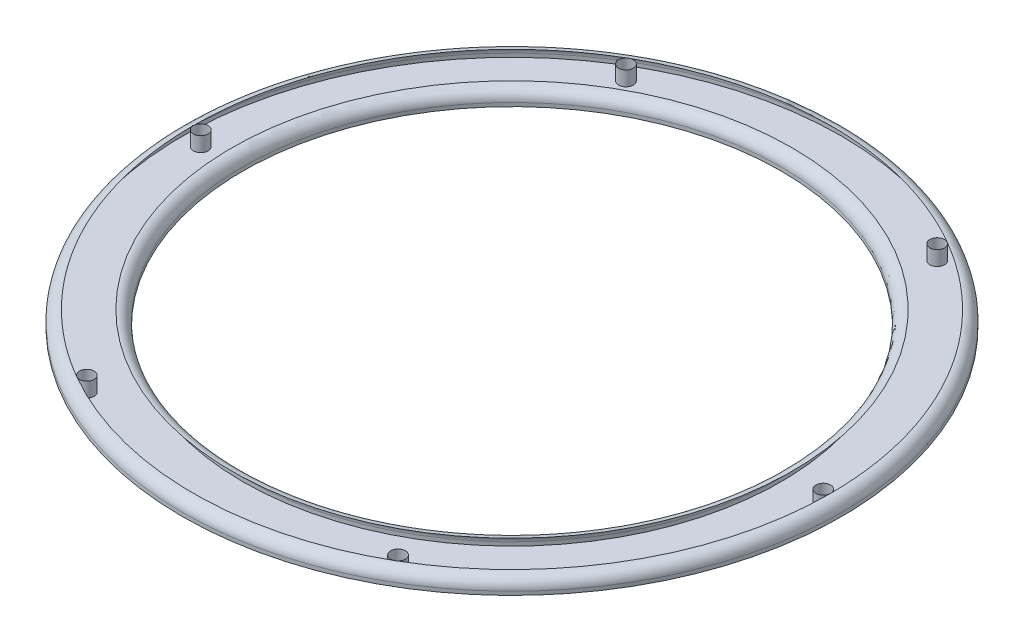
ISO-10303-21;
HEADER;
FILE_DESCRIPTION(('STEP AP214'),'2;1');
FILE_NAME('part.step','',(''),(''),'','','');
FILE_SCHEMA(('AUTOMOTIVE_DESIGN { 1 0 10303 214 1 1 1 1 }'));
ENDSEC;
DATA;
#1=APPLICATION_CONTEXT('core data for automotive mechanical design processes');
#2=APPLICATION_PROTOCOL_DEFINITION('international standard','automotive_design',2000,#1);
#3=PRODUCT_CONTEXT('',#1,'mechanical');
#4=PRODUCT('Part','Part','',(#3));
#5=PRODUCT_RELATED_PRODUCT_CATEGORY('part','',(#4));
#6=PRODUCT_DEFINITION_FORMATION('','',#4);
#7=PRODUCT_DEFINITION_CONTEXT('part definition',#1,'design');
#8=PRODUCT_DEFINITION('design','',#6,#7);
#9=PRODUCT_DEFINITION_SHAPE('','',#8);
#10=(LENGTH_UNIT() NAMED_UNIT(*) SI_UNIT(.MILLI.,.METRE.));
#11=(NAMED_UNIT(*) PLANE_ANGLE_UNIT() SI_UNIT($,.RADIAN.));
#12=(NAMED_UNIT(*) SI_UNIT($,.STERADIAN.) SOLID_ANGLE_UNIT());
#13=UNCERTAINTY_MEASURE_WITH_UNIT(LENGTH_MEASURE(1.E-05),#10,'distance_accuracy_value','');
#14=(GEOMETRIC_REPRESENTATION_CONTEXT(3) GLOBAL_UNCERTAINTY_ASSIGNED_CONTEXT((#13)) GLOBAL_UNIT_ASSIGNED_CONTEXT((#10,
#11,#12)) REPRESENTATION_CONTEXT('',''));
#15=CARTESIAN_POINT('',(0.,0.,0.));
#16=DIRECTION('',(0.,0.,1.));
#17=DIRECTION('',(1.,0.,0.));
#18=AXIS2_PLACEMENT_3D('',#15,#16,#17);
#19=CARTESIAN_POINT('',(0.,0.,0.));
#20=DIRECTION('',(0.,-1.,0.));
#21=DIRECTION('',(0.,0.,-1.));
#22=AXIS2_PLACEMENT_3D('',#19,#20,#21);
#23=CYLINDRICAL_SURFACE('',#22,73.5);
#24=CARTESIAN_POINT('',(0.,1.,0.));
#25=DIRECTION('',(0.,-1.,0.));
#26=DIRECTION('',(0.,0.,-1.));
#27=AXIS2_PLACEMENT_3D('',#24,#25,#26);
#28=CIRCLE('',#27,73.5);
#29=CARTESIAN_POINT('',(0.,1.,-73.5));
#30=VERTEX_POINT('',#29);
#31=EDGE_CURVE('E91',#30,#30,#28,.T.);
#32=ORIENTED_EDGE('',*,*,#31,.F.);
#33=EDGE_LOOP('',(#32));
#34=FACE_BOUND('',#33,.T.);
#35=CARTESIAN_POINT('',(0.,0.,0.));
#36=DIRECTION('',(0.,-1.,0.));
#37=DIRECTION('',(0.,0.,-1.));
#38=AXIS2_PLACEMENT_3D('',#35,#36,#37);
#39=CIRCLE('',#38,73.5);
#40=CARTESIAN_POINT('',(0.,0.,-73.5));
#41=VERTEX_POINT('',#40);
#42=EDGE_CURVE('E11',#41,#41,#39,.T.);
#43=ORIENTED_EDGE('',*,*,#42,.T.);
#44=EDGE_LOOP('',(#43));
#45=FACE_BOUND('',#44,.T.);
#46=ADVANCED_FACE('F38',(#34,#45),#23,.F.);
#47=CARTESIAN_POINT('',(-73.5,0.,0.));
#48=DIRECTION('',(0.,1.,0.));
#49=DIRECTION('',(0.,0.,1.));
#50=AXIS2_PLACEMENT_3D('',#47,#48,#49);
#51=PLANE('',#50);
#52=CARTESIAN_POINT('',(-42.5000000000009,0.,-73.6121593216768));
#53=DIRECTION('',(0.,1.,0.));
#54=DIRECTION('',(-0.866025403784433,0.,0.50000000000001));
#55=AXIS2_PLACEMENT_3D('',#52,#53,#54);
#56=CIRCLE('',#55,2.);
#57=CARTESIAN_POINT('',(-44.2320508075697,0.,-72.6121593216768));
#58=VERTEX_POINT('',#57);
#59=EDGE_CURVE('E182',#58,#58,#56,.T.);
#60=ORIENTED_EDGE('',*,*,#59,.T.);
#61=EDGE_LOOP('',(#60));
#62=FACE_BOUND('',#61,.T.);
#63=CARTESIAN_POINT('',(42.4999999999993,0.,-73.6121593216777));
#64=DIRECTION('',(0.,1.,0.));
#65=DIRECTION('',(-0.866025403784443,0.,-0.499999999999992));
#66=AXIS2_PLACEMENT_3D('',#63,#64,#65);
#67=CIRCLE('',#66,2.);
#68=CARTESIAN_POINT('',(40.7679491924304,0.,-74.6121593216777));
#69=VERTEX_POINT('',#68);
#70=EDGE_CURVE('E177',#69,#69,#67,.T.);
#71=ORIENTED_EDGE('',*,*,#70,.T.);
#72=EDGE_LOOP('',(#71));
#73=FACE_BOUND('',#72,.T.);
#74=CARTESIAN_POINT('',(85.,0.,0.));
#75=DIRECTION('',(0.,1.,0.));
#76=DIRECTION('',(0.,0.,-1.));
#77=AXIS2_PLACEMENT_3D('',#74,#75,#76);
#78=CIRCLE('',#77,2.);
#79=CARTESIAN_POINT('',(85.,0.,-2.));
#80=VERTEX_POINT('',#79);
#81=EDGE_CURVE('E170',#80,#80,#78,.T.);
#82=ORIENTED_EDGE('',*,*,#81,.T.);
#83=EDGE_LOOP('',(#82));
#84=FACE_BOUND('',#83,.T.);
#85=CARTESIAN_POINT('',(42.5000000000003,0.,73.6121593216771));
#86=DIRECTION('',(0.,1.,0.));
#87=DIRECTION('',(0.866025403784436,0.,-0.500000000000004));
#88=AXIS2_PLACEMENT_3D('',#85,#86,#87);
#89=CIRCLE('',#88,2.);
#90=CARTESIAN_POINT('',(44.2320508075692,0.,72.6121593216771));
#91=VERTEX_POINT('',#90);
#92=EDGE_CURVE('E167',#91,#91,#89,.T.);
#93=ORIENTED_EDGE('',*,*,#92,.T.);
#94=EDGE_LOOP('',(#93));
#95=FACE_BOUND('',#94,.T.);
#96=CARTESIAN_POINT('',(-42.4999999999998,0.,73.6121593216774));
#97=DIRECTION('',(0.,1.,0.));
#98=DIRECTION('',(0.86602540378444,0.,0.499999999999998));
#99=AXIS2_PLACEMENT_3D('',#96,#97,#98);
#100=CIRCLE('',#99,2.);
#101=CARTESIAN_POINT('',(-40.767949192431,0.,74.6121593216774));
#102=VERTEX_POINT('',#101);
#103=EDGE_CURVE('E88',#102,#102,#100,.T.);
#104=ORIENTED_EDGE('',*,*,#103,.T.);
#105=EDGE_LOOP('',(#104));
#106=FACE_BOUND('',#105,.T.);
#107=CARTESIAN_POINT('',(-85.,0.,0.));
#108=DIRECTION('',(0.,1.,0.));
#109=DIRECTION('',(0.,0.,1.));
#110=AXIS2_PLACEMENT_3D('',#107,#108,#109);
#111=CIRCLE('',#110,2.);
#112=CARTESIAN_POINT('',(-85.,0.,2.));
#113=VERTEX_POINT('',#112);
#114=EDGE_CURVE('E87',#113,#113,#111,.T.);
#115=ORIENTED_EDGE('',*,*,#114,.T.);
#116=EDGE_LOOP('',(#115));
#117=FACE_BOUND('',#116,.T.);
#118=ORIENTED_EDGE('',*,*,#42,.F.);
#119=EDGE_LOOP('',(#118));
#120=FACE_BOUND('',#119,.T.);
#121=CARTESIAN_POINT('',(0.,0.,0.));
#122=DIRECTION('',(0.,-1.,0.));
#123=DIRECTION('',(0.,0.,-1.));
#124=AXIS2_PLACEMENT_3D('',#121,#122,#123);
#125=CIRCLE('',#124,90.);
#126=CARTESIAN_POINT('',(0.,0.,-90.));
#127=VERTEX_POINT('',#126);
#128=EDGE_CURVE('E45',#127,#127,#125,.T.);
#129=ORIENTED_EDGE('',*,*,#128,.T.);
#130=EDGE_LOOP('',(#129));
#131=FACE_BOUND('',#130,.T.);
#132=ADVANCED_FACE('F107',(#62,#73,#84,#95,#106,#117,#120,#131),#51,.F.);
#133=CARTESIAN_POINT('',(0.,0.,0.));
#134=DIRECTION('',(0.,-1.,0.));
#135=DIRECTION('',(0.,0.,-1.));
#136=AXIS2_PLACEMENT_3D('',#133,#134,#135);
#137=CYLINDRICAL_SURFACE('',#136,90.);
#138=ORIENTED_EDGE('',*,*,#128,.F.);
#139=EDGE_LOOP('',(#138));
#140=FACE_BOUND('',#139,.T.);
#141=CARTESIAN_POINT('',(0.,0.999999999999998,0.));
#142=DIRECTION('',(0.,-1.,0.));
#143=DIRECTION('',(0.,0.,-1.));
#144=AXIS2_PLACEMENT_3D('',#141,#142,#143);
#145=CIRCLE('',#144,90.);
#146=CARTESIAN_POINT('',(0.,0.999999999999998,-90.));
#147=VERTEX_POINT('',#146);
#148=EDGE_CURVE('E101',#147,#147,#145,.T.);
#149=ORIENTED_EDGE('',*,*,#148,.T.);
#150=EDGE_LOOP('',(#149));
#151=FACE_BOUND('',#150,.T.);
#152=ADVANCED_FACE('F109',(#140,#151),#137,.T.);
#153=CARTESIAN_POINT('',(0.,0.999999999999998,0.));
#154=DIRECTION('',(0.,-1.,0.));
#155=DIRECTION('',(0.,0.,-1.));
#156=AXIS2_PLACEMENT_3D('',#153,#154,#155);
#157=TOROIDAL_SURFACE('',#156,87.,3.);
#158=ORIENTED_EDGE('',*,*,#148,.F.);
#159=EDGE_LOOP('',(#158));
#160=FACE_BOUND('',#159,.T.);
#161=CARTESIAN_POINT('',(0.,4.,0.));
#162=DIRECTION('',(0.,-1.,0.));
#163=DIRECTION('',(0.,0.,-1.));
#164=AXIS2_PLACEMENT_3D('',#161,#162,#163);
#165=CIRCLE('',#164,87.);
#166=CARTESIAN_POINT('',(-87.,4.,0.));
#167=VERTEX_POINT('',#166);
#168=CARTESIAN_POINT('',(-43.5000000000009,4.,-75.3442101292457));
#169=VERTEX_POINT('',#168);
#170=EDGE_CURVE('E76',#167,#169,#165,.T.);
#171=ORIENTED_EDGE('',*,*,#170,.T.);
#172=CARTESIAN_POINT('',(43.4999999999993,4.,-75.3442101292466));
#173=VERTEX_POINT('',#172);
#174=EDGE_CURVE('E102',#169,#173,#165,.T.);
#175=ORIENTED_EDGE('',*,*,#174,.T.);
#176=CARTESIAN_POINT('',(87.,4.,0.));
#177=VERTEX_POINT('',#176);
#178=EDGE_CURVE('E193',#173,#177,#165,.T.);
#179=ORIENTED_EDGE('',*,*,#178,.T.);
#180=CARTESIAN_POINT('',(43.5000000000003,4.,75.344210129246));
#181=VERTEX_POINT('',#180);
#182=EDGE_CURVE('E194',#177,#181,#165,.T.);
#183=ORIENTED_EDGE('',*,*,#182,.T.);
#184=CARTESIAN_POINT('',(-43.4999999999998,4.,75.3442101292463));
#185=VERTEX_POINT('',#184);
#186=EDGE_CURVE('E79',#181,#185,#165,.T.);
#187=ORIENTED_EDGE('',*,*,#186,.T.);
#188=EDGE_CURVE('E71',#185,#167,#165,.T.);
#189=ORIENTED_EDGE('',*,*,#188,.T.);
#190=EDGE_LOOP('',(#171,#175,#179,#183,#187,#189));
#191=FACE_BOUND('',#190,.T.);
#192=ADVANCED_FACE('F73',(#160,#191),#157,.T.);
#193=CARTESIAN_POINT('',(-76.5,4.,0.));
#194=DIRECTION('',(0.,-1.,0.));
#195=DIRECTION('',(0.,0.,-1.));
#196=AXIS2_PLACEMENT_3D('',#193,#194,#195);
#197=PLANE('',#196);
#198=ORIENTED_EDGE('',*,*,#174,.F.);
#199=CARTESIAN_POINT('',(-42.5000000000009,4.,-73.6121593216768));
#200=DIRECTION('',(0.,1.,0.));
#201=DIRECTION('',(-0.866025403784433,0.,0.50000000000001));
#202=AXIS2_PLACEMENT_3D('',#199,#200,#201);
#203=CIRCLE('',#202,2.);
#204=EDGE_CURVE('E185',#169,#169,#203,.T.);
#205=ORIENTED_EDGE('',*,*,#204,.F.);
#206=ORIENTED_EDGE('',*,*,#170,.F.);
#207=CARTESIAN_POINT('',(-85.,4.,0.));
#208=DIRECTION('',(0.,1.,0.));
#209=DIRECTION('',(0.,0.,1.));
#210=AXIS2_PLACEMENT_3D('',#207,#208,#209);
#211=CIRCLE('',#210,2.);
#212=EDGE_CURVE('E85',#167,#167,#211,.T.);
#213=ORIENTED_EDGE('',*,*,#212,.F.);
#214=ORIENTED_EDGE('',*,*,#188,.F.);
#215=CARTESIAN_POINT('',(-42.4999999999998,4.,73.6121593216774));
#216=DIRECTION('',(0.,1.,0.));
#217=DIRECTION('',(0.86602540378444,0.,0.499999999999998));
#218=AXIS2_PLACEMENT_3D('',#215,#216,#217);
#219=CIRCLE('',#218,2.);
#220=EDGE_CURVE('E50',#185,#185,#219,.T.);
#221=ORIENTED_EDGE('',*,*,#220,.F.);
#222=ORIENTED_EDGE('',*,*,#186,.F.);
#223=CARTESIAN_POINT('',(42.5000000000003,4.,73.6121593216771));
#224=DIRECTION('',(0.,1.,0.));
#225=DIRECTION('',(0.866025403784436,0.,-0.500000000000004));
#226=AXIS2_PLACEMENT_3D('',#223,#224,#225);
#227=CIRCLE('',#226,2.);
#228=EDGE_CURVE('E55',#181,#181,#227,.T.);
#229=ORIENTED_EDGE('',*,*,#228,.F.);
#230=ORIENTED_EDGE('',*,*,#182,.F.);
#231=CARTESIAN_POINT('',(85.,4.,0.));
#232=DIRECTION('',(0.,1.,0.));
#233=DIRECTION('',(0.,0.,-1.));
#234=AXIS2_PLACEMENT_3D('',#231,#232,#233);
#235=CIRCLE('',#234,2.);
#236=EDGE_CURVE('E175',#177,#177,#235,.T.);
#237=ORIENTED_EDGE('',*,*,#236,.F.);
#238=ORIENTED_EDGE('',*,*,#178,.F.);
#239=CARTESIAN_POINT('',(42.4999999999993,4.,-73.6121593216777));
#240=DIRECTION('',(0.,1.,0.));
#241=DIRECTION('',(-0.866025403784443,0.,-0.499999999999992));
#242=AXIS2_PLACEMENT_3D('',#239,#240,#241);
#243=CIRCLE('',#242,2.);
#244=EDGE_CURVE('E180',#173,#173,#243,.T.);
#245=ORIENTED_EDGE('',*,*,#244,.F.);
#246=EDGE_LOOP('',(#198,#205,#206,#213,#214,#221,#222,#229,#230,#237,#238,#245));
#247=FACE_BOUND('',#246,.T.);
#248=CARTESIAN_POINT('',(0.,4.,0.));
#249=DIRECTION('',(0.,-1.,0.));
#250=DIRECTION('',(0.,0.,-1.));
#251=AXIS2_PLACEMENT_3D('',#248,#249,#250);
#252=CIRCLE('',#251,76.5);
#253=CARTESIAN_POINT('',(0.,4.,-76.5));
#254=VERTEX_POINT('',#253);
#255=EDGE_CURVE('E82',#254,#254,#252,.T.);
#256=ORIENTED_EDGE('',*,*,#255,.T.);
#257=EDGE_LOOP('',(#256));
#258=FACE_BOUND('',#257,.T.);
#259=ADVANCED_FACE('F116',(#247,#258),#197,.F.);
#260=CARTESIAN_POINT('',(0.,1.,0.));
#261=DIRECTION('',(0.,-1.,0.));
#262=DIRECTION('',(0.,0.,-1.));
#263=AXIS2_PLACEMENT_3D('',#260,#261,#262);
#264=TOROIDAL_SURFACE('',#263,76.5,3.);
#265=ORIENTED_EDGE('',*,*,#255,.F.);
#266=EDGE_LOOP('',(#265));
#267=FACE_BOUND('',#266,.T.);
#268=ORIENTED_EDGE('',*,*,#31,.T.);
#269=EDGE_LOOP('',(#268));
#270=FACE_BOUND('',#269,.T.);
#271=ADVANCED_FACE('F121',(#267,#270),#264,.T.);
#272=CARTESIAN_POINT('',(-85.,0.,0.));
#273=DIRECTION('',(0.,1.,0.));
#274=DIRECTION('',(0.,0.,1.));
#275=AXIS2_PLACEMENT_3D('',#272,#273,#274);
#276=CYLINDRICAL_SURFACE('',#275,2.);
#277=ORIENTED_EDGE('',*,*,#114,.F.);
#278=EDGE_LOOP('',(#277));
#279=FACE_BOUND('',#278,.T.);
#280=ORIENTED_EDGE('',*,*,#212,.T.);
#281=EDGE_LOOP('',(#280));
#282=FACE_BOUND('',#281,.T.);
#283=ADVANCED_FACE('F86',(#279,#282),#276,.F.);
#284=CARTESIAN_POINT('',(-42.4999999999998,0.,73.6121593216774));
#285=DIRECTION('',(0.,1.,0.));
#286=DIRECTION('',(0.,0.,1.));
#287=AXIS2_PLACEMENT_3D('',#284,#285,#286);
#288=CYLINDRICAL_SURFACE('',#287,2.);
#289=ORIENTED_EDGE('',*,*,#103,.F.);
#290=EDGE_LOOP('',(#289));
#291=FACE_BOUND('',#290,.T.);
#292=ORIENTED_EDGE('',*,*,#220,.T.);
#293=EDGE_LOOP('',(#292));
#294=FACE_BOUND('',#293,.T.);
#295=ADVANCED_FACE('F140',(#291,#294),#288,.F.);
#296=CARTESIAN_POINT('',(42.5000000000003,0.,73.6121593216771));
#297=DIRECTION('',(0.,1.,0.));
#298=DIRECTION('',(0.,0.,1.));
#299=AXIS2_PLACEMENT_3D('',#296,#297,#298);
#300=CYLINDRICAL_SURFACE('',#299,2.);
#301=ORIENTED_EDGE('',*,*,#92,.F.);
#302=EDGE_LOOP('',(#301));
#303=FACE_BOUND('',#302,.T.);
#304=ORIENTED_EDGE('',*,*,#228,.T.);
#305=EDGE_LOOP('',(#304));
#306=FACE_BOUND('',#305,.T.);
#307=ADVANCED_FACE('F147',(#303,#306),#300,.F.);
#308=CARTESIAN_POINT('',(85.,0.,0.));
#309=DIRECTION('',(0.,1.,0.));
#310=DIRECTION('',(0.,0.,1.));
#311=AXIS2_PLACEMENT_3D('',#308,#309,#310);
#312=CYLINDRICAL_SURFACE('',#311,2.);
#313=ORIENTED_EDGE('',*,*,#81,.F.);
#314=EDGE_LOOP('',(#313));
#315=FACE_BOUND('',#314,.T.);
#316=ORIENTED_EDGE('',*,*,#236,.T.);
#317=EDGE_LOOP('',(#316));
#318=FACE_BOUND('',#317,.T.);
#319=ADVANCED_FACE('F156',(#315,#318),#312,.F.);
#320=CARTESIAN_POINT('',(42.4999999999993,0.,-73.6121593216777));
#321=DIRECTION('',(0.,1.,0.));
#322=DIRECTION('',(0.,0.,1.));
#323=AXIS2_PLACEMENT_3D('',#320,#321,#322);
#324=CYLINDRICAL_SURFACE('',#323,2.);
#325=ORIENTED_EDGE('',*,*,#70,.F.);
#326=EDGE_LOOP('',(#325));
#327=FACE_BOUND('',#326,.T.);
#328=ORIENTED_EDGE('',*,*,#244,.T.);
#329=EDGE_LOOP('',(#328));
#330=FACE_BOUND('',#329,.T.);
#331=ADVANCED_FACE('F152',(#327,#330),#324,.F.);
#332=CARTESIAN_POINT('',(-42.5000000000009,0.,-73.6121593216768));
#333=DIRECTION('',(0.,1.,0.));
#334=DIRECTION('',(0.,0.,1.));
#335=AXIS2_PLACEMENT_3D('',#332,#333,#334);
#336=CYLINDRICAL_SURFACE('',#335,2.);
#337=ORIENTED_EDGE('',*,*,#59,.F.);
#338=EDGE_LOOP('',(#337));
#339=FACE_BOUND('',#338,.T.);
#340=ORIENTED_EDGE('',*,*,#204,.T.);
#341=EDGE_LOOP('',(#340));
#342=FACE_BOUND('',#341,.T.);
#343=ADVANCED_FACE('F149',(#339,#342),#336,.F.);
#344=CLOSED_SHELL('',(#46,#132,#152,#192,#259,#271,#283,#295,#307,#319,#331,#343));
#345=MANIFOLD_SOLID_BREP('B2',#344);
#346=ADVANCED_BREP_SHAPE_REPRESENTATION('',(#18,#345),#14);
#347=SHAPE_DEFINITION_REPRESENTATION(#9,#346);
ENDSEC;
END-ISO-10303-21;
